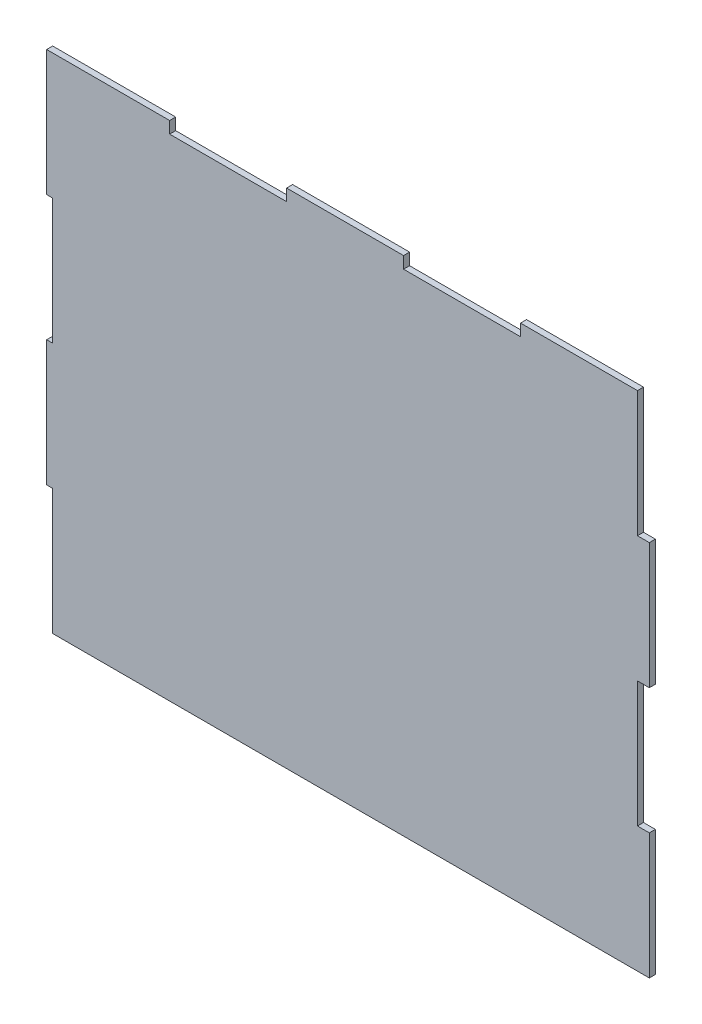
ISO-10303-21;
HEADER;
FILE_DESCRIPTION(('STEP AP214'),'2;1');
FILE_NAME('part.step','',(''),(''),'','','');
FILE_SCHEMA(('AUTOMOTIVE_DESIGN { 1 0 10303 214 1 1 1 1 }'));
ENDSEC;
DATA;
#1=APPLICATION_CONTEXT('core data for automotive mechanical design processes');
#2=APPLICATION_PROTOCOL_DEFINITION('international standard','automotive_design',2000,#1);
#3=PRODUCT_CONTEXT('',#1,'mechanical');
#4=PRODUCT('Part','Part','',(#3));
#5=PRODUCT_RELATED_PRODUCT_CATEGORY('part','',(#4));
#6=PRODUCT_DEFINITION_FORMATION('','',#4);
#7=PRODUCT_DEFINITION_CONTEXT('part definition',#1,'design');
#8=PRODUCT_DEFINITION('design','',#6,#7);
#9=PRODUCT_DEFINITION_SHAPE('','',#8);
#10=(LENGTH_UNIT() NAMED_UNIT(*) SI_UNIT(.MILLI.,.METRE.));
#11=(NAMED_UNIT(*) PLANE_ANGLE_UNIT() SI_UNIT($,.RADIAN.));
#12=(NAMED_UNIT(*) SI_UNIT($,.STERADIAN.) SOLID_ANGLE_UNIT());
#13=UNCERTAINTY_MEASURE_WITH_UNIT(LENGTH_MEASURE(1.E-05),#10,'distance_accuracy_value','');
#14=(GEOMETRIC_REPRESENTATION_CONTEXT(3) GLOBAL_UNCERTAINTY_ASSIGNED_CONTEXT((#13)) GLOBAL_UNIT_ASSIGNED_CONTEXT((#10,
#11,#12)) REPRESENTATION_CONTEXT('',''));
#15=CARTESIAN_POINT('',(0.,0.,0.));
#16=DIRECTION('',(0.,0.,1.));
#17=DIRECTION('',(1.,0.,0.));
#18=AXIS2_PLACEMENT_3D('',#15,#16,#17);
#19=CARTESIAN_POINT('',(59.0804,253.981711341585,3.048));
#20=DIRECTION('',(-1.,0.,0.));
#21=DIRECTION('',(0.,0.,1.));
#22=AXIS2_PLACEMENT_3D('',#19,#20,#21);
#23=PLANE('',#22);
#24=DIRECTION('',(0.,1.,0.));
#25=VECTOR('',#24,1.);
#26=CARTESIAN_POINT('',(59.0804,253.981711341585,0.));
#27=LINE('',#26,#25);
#28=CARTESIAN_POINT('',(59.0804,248.012711341585,0.));
#29=VERTEX_POINT('',#28);
#30=CARTESIAN_POINT('',(59.0804,253.981711341585,0.));
#31=VERTEX_POINT('',#30);
#32=EDGE_CURVE('E224',#29,#31,#27,.T.);
#33=ORIENTED_EDGE('',*,*,#32,.T.);
#34=DIRECTION('',(0.,0.,-1.));
#35=VECTOR('',#34,1.);
#36=CARTESIAN_POINT('',(59.0804,253.981711341585,3.048));
#37=LINE('',#36,#35);
#38=CARTESIAN_POINT('',(59.0804,253.981711341585,3.048));
#39=VERTEX_POINT('',#38);
#40=EDGE_CURVE('E11',#39,#31,#37,.T.);
#41=ORIENTED_EDGE('',*,*,#40,.F.);
#42=DIRECTION('',(0.,1.,0.));
#43=VECTOR('',#42,1.);
#44=CARTESIAN_POINT('',(59.0804,253.981711341585,3.048));
#45=LINE('',#44,#43);
#46=CARTESIAN_POINT('',(59.0804,248.012711341585,3.048));
#47=VERTEX_POINT('',#46);
#48=EDGE_CURVE('E270',#47,#39,#45,.T.);
#49=ORIENTED_EDGE('',*,*,#48,.F.);
#50=DIRECTION('',(0.,0.,-1.));
#51=VECTOR('',#50,1.);
#52=CARTESIAN_POINT('',(59.0804,248.012711341585,3.048));
#53=LINE('',#52,#51);
#54=EDGE_CURVE('E220',#47,#29,#53,.T.);
#55=ORIENTED_EDGE('',*,*,#54,.T.);
#56=EDGE_LOOP('',(#33,#41,#49,#55));
#57=FACE_BOUND('',#56,.T.);
#58=ADVANCED_FACE('F32',(#57),#23,.F.);
#59=CARTESIAN_POINT('',(-3.048,253.981711341585,3.048));
#60=DIRECTION('',(0.,-1.,0.));
#61=DIRECTION('',(0.,0.,-1.));
#62=AXIS2_PLACEMENT_3D('',#59,#60,#61);
#63=PLANE('',#62);
#64=DIRECTION('',(-1.,0.,0.));
#65=VECTOR('',#64,1.);
#66=CARTESIAN_POINT('',(-3.048,253.981711341585,0.));
#67=LINE('',#66,#65);
#68=CARTESIAN_POINT('',(-3.048,253.981711341585,0.));
#69=VERTEX_POINT('',#68);
#70=EDGE_CURVE('E227',#31,#69,#67,.T.);
#71=ORIENTED_EDGE('',*,*,#70,.T.);
#72=DIRECTION('',(0.,0.,-1.));
#73=VECTOR('',#72,1.);
#74=CARTESIAN_POINT('',(-3.048,253.981711341585,3.048));
#75=LINE('',#74,#73);
#76=CARTESIAN_POINT('',(-3.048,253.981711341585,3.048));
#77=VERTEX_POINT('',#76);
#78=EDGE_CURVE('E40',#77,#69,#75,.T.);
#79=ORIENTED_EDGE('',*,*,#78,.F.);
#80=DIRECTION('',(-1.,0.,0.));
#81=VECTOR('',#80,1.);
#82=CARTESIAN_POINT('',(-3.048,253.981711341585,3.048));
#83=LINE('',#82,#81);
#84=EDGE_CURVE('E139',#39,#77,#83,.T.);
#85=ORIENTED_EDGE('',*,*,#84,.F.);
#86=ORIENTED_EDGE('',*,*,#40,.T.);
#87=EDGE_LOOP('',(#71,#79,#85,#86));
#88=FACE_BOUND('',#87,.T.);
#89=ADVANCED_FACE('F408',(#88),#63,.F.);
#90=CARTESIAN_POINT('',(-3.048,190.5,3.048));
#91=DIRECTION('',(1.,0.,0.));
#92=DIRECTION('',(0.,0.,-1.));
#93=AXIS2_PLACEMENT_3D('',#90,#91,#92);
#94=PLANE('',#93);
#95=DIRECTION('',(0.,-1.,0.));
#96=VECTOR('',#95,1.);
#97=CARTESIAN_POINT('',(-3.048,190.5,0.));
#98=LINE('',#97,#96);
#99=CARTESIAN_POINT('',(-3.048,190.5,0.));
#100=VERTEX_POINT('',#99);
#101=EDGE_CURVE('E229',#69,#100,#98,.T.);
#102=ORIENTED_EDGE('',*,*,#101,.T.);
#103=DIRECTION('',(0.,0.,-1.));
#104=VECTOR('',#103,1.);
#105=CARTESIAN_POINT('',(-3.048,190.5,3.048));
#106=LINE('',#105,#104);
#107=CARTESIAN_POINT('',(-3.048,190.5,3.048));
#108=VERTEX_POINT('',#107);
#109=EDGE_CURVE('E325',#108,#100,#106,.T.);
#110=ORIENTED_EDGE('',*,*,#109,.F.);
#111=DIRECTION('',(0.,-1.,0.));
#112=VECTOR('',#111,1.);
#113=CARTESIAN_POINT('',(-3.048,190.5,3.048));
#114=LINE('',#113,#112);
#115=EDGE_CURVE('E333',#77,#108,#114,.T.);
#116=ORIENTED_EDGE('',*,*,#115,.F.);
#117=ORIENTED_EDGE('',*,*,#78,.T.);
#118=EDGE_LOOP('',(#102,#110,#116,#117));
#119=FACE_BOUND('',#118,.T.);
#120=ADVANCED_FACE('F331',(#119),#94,.F.);
#121=CARTESIAN_POINT('',(0.,190.5,3.048));
#122=DIRECTION('',(0.,1.,0.));
#123=DIRECTION('',(0.,0.,1.));
#124=AXIS2_PLACEMENT_3D('',#121,#122,#123);
#125=PLANE('',#124);
#126=DIRECTION('',(1.,0.,0.));
#127=VECTOR('',#126,1.);
#128=CARTESIAN_POINT('',(0.,190.5,0.));
#129=LINE('',#128,#127);
#130=CARTESIAN_POINT('',(0.,190.5,0.));
#131=VERTEX_POINT('',#130);
#132=EDGE_CURVE('E231',#100,#131,#129,.T.);
#133=ORIENTED_EDGE('',*,*,#132,.T.);
#134=DIRECTION('',(0.,0.,-1.));
#135=VECTOR('',#134,1.);
#136=CARTESIAN_POINT('',(0.,190.5,3.048));
#137=LINE('',#136,#135);
#138=CARTESIAN_POINT('',(0.,190.5,3.048));
#139=VERTEX_POINT('',#138);
#140=EDGE_CURVE('E322',#139,#131,#137,.T.);
#141=ORIENTED_EDGE('',*,*,#140,.F.);
#142=DIRECTION('',(1.,0.,0.));
#143=VECTOR('',#142,1.);
#144=CARTESIAN_POINT('',(0.,190.5,3.048));
#145=LINE('',#144,#143);
#146=EDGE_CURVE('E351',#108,#139,#145,.T.);
#147=ORIENTED_EDGE('',*,*,#146,.F.);
#148=ORIENTED_EDGE('',*,*,#109,.T.);
#149=EDGE_LOOP('',(#133,#141,#147,#148));
#150=FACE_BOUND('',#149,.T.);
#151=ADVANCED_FACE('F342',(#150),#125,.F.);
#152=CARTESIAN_POINT('',(0.,127.,3.048));
#153=DIRECTION('',(1.,0.,0.));
#154=DIRECTION('',(0.,0.,-1.));
#155=AXIS2_PLACEMENT_3D('',#152,#153,#154);
#156=PLANE('',#155);
#157=DIRECTION('',(0.,-1.,0.));
#158=VECTOR('',#157,1.);
#159=CARTESIAN_POINT('',(0.,127.,0.));
#160=LINE('',#159,#158);
#161=CARTESIAN_POINT('',(0.,127.,0.));
#162=VERTEX_POINT('',#161);
#163=EDGE_CURVE('E233',#131,#162,#160,.T.);
#164=ORIENTED_EDGE('',*,*,#163,.T.);
#165=DIRECTION('',(0.,0.,-1.));
#166=VECTOR('',#165,1.);
#167=CARTESIAN_POINT('',(0.,127.,3.048));
#168=LINE('',#167,#166);
#169=CARTESIAN_POINT('',(0.,127.,3.048));
#170=VERTEX_POINT('',#169);
#171=EDGE_CURVE('E319',#170,#162,#168,.T.);
#172=ORIENTED_EDGE('',*,*,#171,.F.);
#173=DIRECTION('',(0.,-1.,0.));
#174=VECTOR('',#173,1.);
#175=CARTESIAN_POINT('',(0.,127.,3.048));
#176=LINE('',#175,#174);
#177=EDGE_CURVE('E348',#139,#170,#176,.T.);
#178=ORIENTED_EDGE('',*,*,#177,.F.);
#179=ORIENTED_EDGE('',*,*,#140,.T.);
#180=EDGE_LOOP('',(#164,#172,#178,#179));
#181=FACE_BOUND('',#180,.T.);
#182=ADVANCED_FACE('F346',(#181),#156,.F.);
#183=CARTESIAN_POINT('',(0.,127.,3.048));
#184=DIRECTION('',(0.,-1.,0.));
#185=DIRECTION('',(0.,0.,-1.));
#186=AXIS2_PLACEMENT_3D('',#183,#184,#185);
#187=PLANE('',#186);
#188=DIRECTION('',(-1.,0.,0.));
#189=VECTOR('',#188,1.);
#190=CARTESIAN_POINT('',(0.,127.,0.));
#191=LINE('',#190,#189);
#192=CARTESIAN_POINT('',(-3.048,127.,0.));
#193=VERTEX_POINT('',#192);
#194=EDGE_CURVE('E235',#162,#193,#191,.T.);
#195=ORIENTED_EDGE('',*,*,#194,.T.);
#196=DIRECTION('',(0.,0.,-1.));
#197=VECTOR('',#196,1.);
#198=CARTESIAN_POINT('',(-3.048,127.,3.048));
#199=LINE('',#198,#197);
#200=CARTESIAN_POINT('',(-3.048,127.,3.048));
#201=VERTEX_POINT('',#200);
#202=EDGE_CURVE('E316',#201,#193,#199,.T.);
#203=ORIENTED_EDGE('',*,*,#202,.F.);
#204=DIRECTION('',(-1.,0.,0.));
#205=VECTOR('',#204,1.);
#206=CARTESIAN_POINT('',(0.,127.,3.048));
#207=LINE('',#206,#205);
#208=EDGE_CURVE('E350',#170,#201,#207,.T.);
#209=ORIENTED_EDGE('',*,*,#208,.F.);
#210=ORIENTED_EDGE('',*,*,#171,.T.);
#211=EDGE_LOOP('',(#195,#203,#209,#210));
#212=FACE_BOUND('',#211,.T.);
#213=ADVANCED_FACE('F421',(#212),#187,.F.);
#214=CARTESIAN_POINT('',(-3.048,63.5,3.048));
#215=DIRECTION('',(1.,0.,0.));
#216=DIRECTION('',(0.,0.,-1.));
#217=AXIS2_PLACEMENT_3D('',#214,#215,#216);
#218=PLANE('',#217);
#219=DIRECTION('',(0.,-1.,0.));
#220=VECTOR('',#219,1.);
#221=CARTESIAN_POINT('',(-3.048,63.5,0.));
#222=LINE('',#221,#220);
#223=CARTESIAN_POINT('',(-3.048,63.5,0.));
#224=VERTEX_POINT('',#223);
#225=EDGE_CURVE('E237',#193,#224,#222,.T.);
#226=ORIENTED_EDGE('',*,*,#225,.T.);
#227=DIRECTION('',(0.,0.,-1.));
#228=VECTOR('',#227,1.);
#229=CARTESIAN_POINT('',(-3.048,63.5,3.048));
#230=LINE('',#229,#228);
#231=CARTESIAN_POINT('',(-3.048,63.5,3.048));
#232=VERTEX_POINT('',#231);
#233=EDGE_CURVE('E313',#232,#224,#230,.T.);
#234=ORIENTED_EDGE('',*,*,#233,.F.);
#235=DIRECTION('',(0.,-1.,0.));
#236=VECTOR('',#235,1.);
#237=CARTESIAN_POINT('',(-3.048,63.5,3.048));
#238=LINE('',#237,#236);
#239=EDGE_CURVE('E353',#201,#232,#238,.T.);
#240=ORIENTED_EDGE('',*,*,#239,.F.);
#241=ORIENTED_EDGE('',*,*,#202,.T.);
#242=EDGE_LOOP('',(#226,#234,#240,#241));
#243=FACE_BOUND('',#242,.T.);
#244=ADVANCED_FACE('F424',(#243),#218,.F.);
#245=CARTESIAN_POINT('',(0.,63.5,3.048));
#246=DIRECTION('',(0.,1.,0.));
#247=DIRECTION('',(0.,0.,1.));
#248=AXIS2_PLACEMENT_3D('',#245,#246,#247);
#249=PLANE('',#248);
#250=DIRECTION('',(1.,0.,0.));
#251=VECTOR('',#250,1.);
#252=CARTESIAN_POINT('',(0.,63.5,0.));
#253=LINE('',#252,#251);
#254=CARTESIAN_POINT('',(0.,63.5,0.));
#255=VERTEX_POINT('',#254);
#256=EDGE_CURVE('E239',#224,#255,#253,.T.);
#257=ORIENTED_EDGE('',*,*,#256,.T.);
#258=DIRECTION('',(0.,0.,-1.));
#259=VECTOR('',#258,1.);
#260=CARTESIAN_POINT('',(0.,63.5,3.048));
#261=LINE('',#260,#259);
#262=CARTESIAN_POINT('',(0.,63.5,3.048));
#263=VERTEX_POINT('',#262);
#264=EDGE_CURVE('E310',#263,#255,#261,.T.);
#265=ORIENTED_EDGE('',*,*,#264,.F.);
#266=DIRECTION('',(1.,0.,0.));
#267=VECTOR('',#266,1.);
#268=CARTESIAN_POINT('',(0.,63.5,3.048));
#269=LINE('',#268,#267);
#270=EDGE_CURVE('E359',#232,#263,#269,.T.);
#271=ORIENTED_EDGE('',*,*,#270,.F.);
#272=ORIENTED_EDGE('',*,*,#233,.T.);
#273=EDGE_LOOP('',(#257,#265,#271,#272));
#274=FACE_BOUND('',#273,.T.);
#275=ADVANCED_FACE('F428',(#274),#249,.F.);
#276=CARTESIAN_POINT('',(0.,0.,3.048));
#277=DIRECTION('',(1.,0.,0.));
#278=DIRECTION('',(0.,0.,-1.));
#279=AXIS2_PLACEMENT_3D('',#276,#277,#278);
#280=PLANE('',#279);
#281=DIRECTION('',(0.,-1.,0.));
#282=VECTOR('',#281,1.);
#283=CARTESIAN_POINT('',(0.,0.,0.));
#284=LINE('',#283,#282);
#285=CARTESIAN_POINT('',(0.,0.,0.));
#286=VERTEX_POINT('',#285);
#287=EDGE_CURVE('E241',#255,#286,#284,.T.);
#288=ORIENTED_EDGE('',*,*,#287,.T.);
#289=DIRECTION('',(0.,0.,-1.));
#290=VECTOR('',#289,1.);
#291=CARTESIAN_POINT('',(0.,0.,3.048));
#292=LINE('',#291,#290);
#293=CARTESIAN_POINT('',(0.,0.,3.048));
#294=VERTEX_POINT('',#293);
#295=EDGE_CURVE('E307',#294,#286,#292,.T.);
#296=ORIENTED_EDGE('',*,*,#295,.F.);
#297=DIRECTION('',(0.,-1.,0.));
#298=VECTOR('',#297,1.);
#299=CARTESIAN_POINT('',(0.,0.,3.048));
#300=LINE('',#299,#298);
#301=EDGE_CURVE('E361',#263,#294,#300,.T.);
#302=ORIENTED_EDGE('',*,*,#301,.F.);
#303=ORIENTED_EDGE('',*,*,#264,.T.);
#304=EDGE_LOOP('',(#288,#296,#302,#303));
#305=FACE_BOUND('',#304,.T.);
#306=ADVANCED_FACE('F432',(#305),#280,.F.);
#307=CARTESIAN_POINT('',(0.,0.,3.048));
#308=DIRECTION('',(0.,1.,0.));
#309=DIRECTION('',(0.,0.,1.));
#310=AXIS2_PLACEMENT_3D('',#307,#308,#309);
#311=PLANE('',#310);
#312=DIRECTION('',(1.,0.,0.));
#313=VECTOR('',#312,1.);
#314=CARTESIAN_POINT('',(0.,0.,0.));
#315=LINE('',#314,#313);
#316=CARTESIAN_POINT('',(301.3964,0.,0.));
#317=VERTEX_POINT('',#316);
#318=EDGE_CURVE('E243',#286,#317,#315,.T.);
#319=ORIENTED_EDGE('',*,*,#318,.T.);
#320=DIRECTION('',(0.,0.,-1.));
#321=VECTOR('',#320,1.);
#322=CARTESIAN_POINT('',(301.3964,0.,3.048));
#323=LINE('',#322,#321);
#324=CARTESIAN_POINT('',(301.3964,0.,3.048));
#325=VERTEX_POINT('',#324);
#326=EDGE_CURVE('E304',#325,#317,#323,.T.);
#327=ORIENTED_EDGE('',*,*,#326,.F.);
#328=DIRECTION('',(1.,0.,0.));
#329=VECTOR('',#328,1.);
#330=CARTESIAN_POINT('',(0.,0.,3.048));
#331=LINE('',#330,#329);
#332=EDGE_CURVE('E363',#294,#325,#331,.T.);
#333=ORIENTED_EDGE('',*,*,#332,.F.);
#334=ORIENTED_EDGE('',*,*,#295,.T.);
#335=EDGE_LOOP('',(#319,#327,#333,#334));
#336=FACE_BOUND('',#335,.T.);
#337=ADVANCED_FACE('F436',(#336),#311,.F.);
#338=CARTESIAN_POINT('',(301.3964,0.,3.048));
#339=DIRECTION('',(-1.,0.,0.));
#340=DIRECTION('',(0.,0.,1.));
#341=AXIS2_PLACEMENT_3D('',#338,#339,#340);
#342=PLANE('',#341);
#343=DIRECTION('',(0.,1.,0.));
#344=VECTOR('',#343,1.);
#345=CARTESIAN_POINT('',(301.3964,0.,0.));
#346=LINE('',#345,#344);
#347=CARTESIAN_POINT('',(301.3964,63.5,0.));
#348=VERTEX_POINT('',#347);
#349=EDGE_CURVE('E245',#317,#348,#346,.T.);
#350=ORIENTED_EDGE('',*,*,#349,.T.);
#351=DIRECTION('',(0.,0.,-1.));
#352=VECTOR('',#351,1.);
#353=CARTESIAN_POINT('',(301.3964,63.5,3.048));
#354=LINE('',#353,#352);
#355=CARTESIAN_POINT('',(301.3964,63.5,3.048));
#356=VERTEX_POINT('',#355);
#357=EDGE_CURVE('E301',#356,#348,#354,.T.);
#358=ORIENTED_EDGE('',*,*,#357,.F.);
#359=DIRECTION('',(0.,1.,0.));
#360=VECTOR('',#359,1.);
#361=CARTESIAN_POINT('',(301.3964,0.,3.048));
#362=LINE('',#361,#360);
#363=EDGE_CURVE('E365',#325,#356,#362,.T.);
#364=ORIENTED_EDGE('',*,*,#363,.F.);
#365=ORIENTED_EDGE('',*,*,#326,.T.);
#366=EDGE_LOOP('',(#350,#358,#364,#365));
#367=FACE_BOUND('',#366,.T.);
#368=ADVANCED_FACE('F440',(#367),#342,.F.);
#369=CARTESIAN_POINT('',(301.3964,63.5,3.048));
#370=DIRECTION('',(0.,-1.,0.));
#371=DIRECTION('',(0.,0.,-1.));
#372=AXIS2_PLACEMENT_3D('',#369,#370,#371);
#373=PLANE('',#372);
#374=DIRECTION('',(-1.,0.,0.));
#375=VECTOR('',#374,1.);
#376=CARTESIAN_POINT('',(301.3964,63.5,0.));
#377=LINE('',#376,#375);
#378=CARTESIAN_POINT('',(295.402,63.5,0.));
#379=VERTEX_POINT('',#378);
#380=EDGE_CURVE('E247',#348,#379,#377,.T.);
#381=ORIENTED_EDGE('',*,*,#380,.T.);
#382=DIRECTION('',(0.,0.,-1.));
#383=VECTOR('',#382,1.);
#384=CARTESIAN_POINT('',(295.402,63.5,3.048));
#385=LINE('',#384,#383);
#386=CARTESIAN_POINT('',(295.402,63.5,3.048));
#387=VERTEX_POINT('',#386);
#388=EDGE_CURVE('E298',#387,#379,#385,.T.);
#389=ORIENTED_EDGE('',*,*,#388,.F.);
#390=DIRECTION('',(-1.,0.,0.));
#391=VECTOR('',#390,1.);
#392=CARTESIAN_POINT('',(301.3964,63.5,3.048));
#393=LINE('',#392,#391);
#394=EDGE_CURVE('E367',#356,#387,#393,.T.);
#395=ORIENTED_EDGE('',*,*,#394,.F.);
#396=ORIENTED_EDGE('',*,*,#357,.T.);
#397=EDGE_LOOP('',(#381,#389,#395,#396));
#398=FACE_BOUND('',#397,.T.);
#399=ADVANCED_FACE('F444',(#398),#373,.F.);
#400=CARTESIAN_POINT('',(295.402,63.5,3.048));
#401=DIRECTION('',(-1.,0.,0.));
#402=DIRECTION('',(0.,0.,1.));
#403=AXIS2_PLACEMENT_3D('',#400,#401,#402);
#404=PLANE('',#403);
#405=DIRECTION('',(0.,1.,0.));
#406=VECTOR('',#405,1.);
#407=CARTESIAN_POINT('',(295.402,63.5,0.));
#408=LINE('',#407,#406);
#409=CARTESIAN_POINT('',(295.402,126.981711341585,0.));
#410=VERTEX_POINT('',#409);
#411=EDGE_CURVE('E249',#379,#410,#408,.T.);
#412=ORIENTED_EDGE('',*,*,#411,.T.);
#413=DIRECTION('',(0.,0.,-1.));
#414=VECTOR('',#413,1.);
#415=CARTESIAN_POINT('',(295.402,126.981711341585,3.048));
#416=LINE('',#415,#414);
#417=CARTESIAN_POINT('',(295.402,126.981711341585,3.048));
#418=VERTEX_POINT('',#417);
#419=EDGE_CURVE('E295',#418,#410,#416,.T.);
#420=ORIENTED_EDGE('',*,*,#419,.F.);
#421=DIRECTION('',(0.,1.,0.));
#422=VECTOR('',#421,1.);
#423=CARTESIAN_POINT('',(295.402,63.5,3.048));
#424=LINE('',#423,#422);
#425=EDGE_CURVE('E369',#387,#418,#424,.T.);
#426=ORIENTED_EDGE('',*,*,#425,.F.);
#427=ORIENTED_EDGE('',*,*,#388,.T.);
#428=EDGE_LOOP('',(#412,#420,#426,#427));
#429=FACE_BOUND('',#428,.T.);
#430=ADVANCED_FACE('F448',(#429),#404,.F.);
#431=CARTESIAN_POINT('',(295.402,126.981711341585,3.048));
#432=DIRECTION('',(0.,1.,0.));
#433=DIRECTION('',(0.,0.,1.));
#434=AXIS2_PLACEMENT_3D('',#431,#432,#433);
#435=PLANE('',#434);
#436=DIRECTION('',(1.,0.,0.));
#437=VECTOR('',#436,1.);
#438=CARTESIAN_POINT('',(295.402,126.981711341585,0.));
#439=LINE('',#438,#437);
#440=CARTESIAN_POINT('',(301.3964,126.981711341585,0.));
#441=VERTEX_POINT('',#440);
#442=EDGE_CURVE('E251',#410,#441,#439,.T.);
#443=ORIENTED_EDGE('',*,*,#442,.T.);
#444=DIRECTION('',(0.,0.,-1.));
#445=VECTOR('',#444,1.);
#446=CARTESIAN_POINT('',(301.3964,126.981711341585,3.048));
#447=LINE('',#446,#445);
#448=CARTESIAN_POINT('',(301.3964,126.981711341585,3.048));
#449=VERTEX_POINT('',#448);
#450=EDGE_CURVE('E292',#449,#441,#447,.T.);
#451=ORIENTED_EDGE('',*,*,#450,.F.);
#452=DIRECTION('',(1.,0.,0.));
#453=VECTOR('',#452,1.);
#454=CARTESIAN_POINT('',(295.402,126.981711341585,3.048));
#455=LINE('',#454,#453);
#456=EDGE_CURVE('E371',#418,#449,#455,.T.);
#457=ORIENTED_EDGE('',*,*,#456,.F.);
#458=ORIENTED_EDGE('',*,*,#419,.T.);
#459=EDGE_LOOP('',(#443,#451,#457,#458));
#460=FACE_BOUND('',#459,.T.);
#461=ADVANCED_FACE('F452',(#460),#435,.F.);
#462=CARTESIAN_POINT('',(301.3964,126.981711341585,3.048));
#463=DIRECTION('',(-1.,0.,0.));
#464=DIRECTION('',(0.,-1.,0.));
#465=AXIS2_PLACEMENT_3D('',#462,#463,#464);
#466=PLANE('',#465);
#467=DIRECTION('',(0.,1.,0.));
#468=VECTOR('',#467,1.);
#469=CARTESIAN_POINT('',(301.3964,126.981711341585,0.));
#470=LINE('',#469,#468);
#471=CARTESIAN_POINT('',(301.3964,190.481711341585,0.));
#472=VERTEX_POINT('',#471);
#473=EDGE_CURVE('E253',#441,#472,#470,.T.);
#474=ORIENTED_EDGE('',*,*,#473,.T.);
#475=DIRECTION('',(0.,0.,-1.));
#476=VECTOR('',#475,1.);
#477=CARTESIAN_POINT('',(301.3964,190.481711341585,3.048));
#478=LINE('',#477,#476);
#479=CARTESIAN_POINT('',(301.3964,190.481711341585,3.048));
#480=VERTEX_POINT('',#479);
#481=EDGE_CURVE('E289',#480,#472,#478,.T.);
#482=ORIENTED_EDGE('',*,*,#481,.F.);
#483=DIRECTION('',(0.,1.,0.));
#484=VECTOR('',#483,1.);
#485=CARTESIAN_POINT('',(301.3964,126.981711341585,3.048));
#486=LINE('',#485,#484);
#487=EDGE_CURVE('E373',#449,#480,#486,.T.);
#488=ORIENTED_EDGE('',*,*,#487,.F.);
#489=ORIENTED_EDGE('',*,*,#450,.T.);
#490=EDGE_LOOP('',(#474,#482,#488,#489));
#491=FACE_BOUND('',#490,.T.);
#492=ADVANCED_FACE('F456',(#491),#466,.F.);
#493=CARTESIAN_POINT('',(301.3964,190.481711341585,3.048));
#494=DIRECTION('',(0.,-1.,0.));
#495=DIRECTION('',(0.,0.,-1.));
#496=AXIS2_PLACEMENT_3D('',#493,#494,#495);
#497=PLANE('',#496);
#498=DIRECTION('',(-1.,0.,0.));
#499=VECTOR('',#498,1.);
#500=CARTESIAN_POINT('',(301.3964,190.481711341585,0.));
#501=LINE('',#500,#499);
#502=CARTESIAN_POINT('',(295.402,190.481711341585,0.));
#503=VERTEX_POINT('',#502);
#504=EDGE_CURVE('E255',#472,#503,#501,.T.);
#505=ORIENTED_EDGE('',*,*,#504,.T.);
#506=DIRECTION('',(0.,0.,-1.));
#507=VECTOR('',#506,1.);
#508=CARTESIAN_POINT('',(295.402,190.481711341585,3.048));
#509=LINE('',#508,#507);
#510=CARTESIAN_POINT('',(295.402,190.481711341585,3.048));
#511=VERTEX_POINT('',#510);
#512=EDGE_CURVE('E286',#511,#503,#509,.T.);
#513=ORIENTED_EDGE('',*,*,#512,.F.);
#514=DIRECTION('',(-1.,0.,0.));
#515=VECTOR('',#514,1.);
#516=CARTESIAN_POINT('',(301.3964,190.481711341585,3.048));
#517=LINE('',#516,#515);
#518=EDGE_CURVE('E375',#480,#511,#517,.T.);
#519=ORIENTED_EDGE('',*,*,#518,.F.);
#520=ORIENTED_EDGE('',*,*,#481,.T.);
#521=EDGE_LOOP('',(#505,#513,#519,#520));
#522=FACE_BOUND('',#521,.T.);
#523=ADVANCED_FACE('F460',(#522),#497,.F.);
#524=CARTESIAN_POINT('',(295.402,190.481711341585,3.048));
#525=DIRECTION('',(-1.,0.,0.));
#526=DIRECTION('',(0.,-1.,0.));
#527=AXIS2_PLACEMENT_3D('',#524,#525,#526);
#528=PLANE('',#527);
#529=DIRECTION('',(0.,1.,0.));
#530=VECTOR('',#529,1.);
#531=CARTESIAN_POINT('',(295.402,190.481711341585,0.));
#532=LINE('',#531,#530);
#533=CARTESIAN_POINT('',(295.402,253.981711341585,0.));
#534=VERTEX_POINT('',#533);
#535=EDGE_CURVE('E257',#503,#534,#532,.T.);
#536=ORIENTED_EDGE('',*,*,#535,.T.);
#537=DIRECTION('',(0.,0.,-1.));
#538=VECTOR('',#537,1.);
#539=CARTESIAN_POINT('',(295.402,253.981711341585,3.048));
#540=LINE('',#539,#538);
#541=CARTESIAN_POINT('',(295.402,253.981711341585,3.048));
#542=VERTEX_POINT('',#541);
#543=EDGE_CURVE('E283',#542,#534,#540,.T.);
#544=ORIENTED_EDGE('',*,*,#543,.F.);
#545=DIRECTION('',(0.,1.,0.));
#546=VECTOR('',#545,1.);
#547=CARTESIAN_POINT('',(295.402,190.481711341585,3.048));
#548=LINE('',#547,#546);
#549=EDGE_CURVE('E377',#511,#542,#548,.T.);
#550=ORIENTED_EDGE('',*,*,#549,.F.);
#551=ORIENTED_EDGE('',*,*,#512,.T.);
#552=EDGE_LOOP('',(#536,#544,#550,#551));
#553=FACE_BOUND('',#552,.T.);
#554=ADVANCED_FACE('F464',(#553),#528,.F.);
#555=CARTESIAN_POINT('',(236.3216,253.981711341585,3.048));
#556=DIRECTION('',(0.,-1.,0.));
#557=DIRECTION('',(0.,0.,-1.));
#558=AXIS2_PLACEMENT_3D('',#555,#556,#557);
#559=PLANE('',#558);
#560=DIRECTION('',(-1.,0.,0.));
#561=VECTOR('',#560,1.);
#562=CARTESIAN_POINT('',(236.3216,253.981711341585,0.));
#563=LINE('',#562,#561);
#564=CARTESIAN_POINT('',(236.3216,253.981711341585,0.));
#565=VERTEX_POINT('',#564);
#566=EDGE_CURVE('E259',#534,#565,#563,.T.);
#567=ORIENTED_EDGE('',*,*,#566,.T.);
#568=DIRECTION('',(0.,0.,-1.));
#569=VECTOR('',#568,1.);
#570=CARTESIAN_POINT('',(236.3216,253.981711341585,3.048));
#571=LINE('',#570,#569);
#572=CARTESIAN_POINT('',(236.3216,253.981711341585,3.048));
#573=VERTEX_POINT('',#572);
#574=EDGE_CURVE('E280',#573,#565,#571,.T.);
#575=ORIENTED_EDGE('',*,*,#574,.F.);
#576=DIRECTION('',(-1.,0.,0.));
#577=VECTOR('',#576,1.);
#578=CARTESIAN_POINT('',(236.3216,253.981711341585,3.048));
#579=LINE('',#578,#577);
#580=EDGE_CURVE('E379',#542,#573,#579,.T.);
#581=ORIENTED_EDGE('',*,*,#580,.F.);
#582=ORIENTED_EDGE('',*,*,#543,.T.);
#583=EDGE_LOOP('',(#567,#575,#581,#582));
#584=FACE_BOUND('',#583,.T.);
#585=ADVANCED_FACE('F468',(#584),#559,.F.);
#586=CARTESIAN_POINT('',(236.3216,248.012711341585,3.048));
#587=DIRECTION('',(1.,0.,0.));
#588=DIRECTION('',(0.,0.,-1.));
#589=AXIS2_PLACEMENT_3D('',#586,#587,#588);
#590=PLANE('',#589);
#591=DIRECTION('',(0.,-1.,0.));
#592=VECTOR('',#591,1.);
#593=CARTESIAN_POINT('',(236.3216,248.012711341585,0.));
#594=LINE('',#593,#592);
#595=CARTESIAN_POINT('',(236.3216,248.012711341585,0.));
#596=VERTEX_POINT('',#595);
#597=EDGE_CURVE('E261',#565,#596,#594,.T.);
#598=ORIENTED_EDGE('',*,*,#597,.T.);
#599=DIRECTION('',(0.,0.,-1.));
#600=VECTOR('',#599,1.);
#601=CARTESIAN_POINT('',(236.3216,248.012711341585,3.048));
#602=LINE('',#601,#600);
#603=CARTESIAN_POINT('',(236.3216,248.012711341585,3.048));
#604=VERTEX_POINT('',#603);
#605=EDGE_CURVE('E277',#604,#596,#602,.T.);
#606=ORIENTED_EDGE('',*,*,#605,.F.);
#607=DIRECTION('',(0.,-1.,0.));
#608=VECTOR('',#607,1.);
#609=CARTESIAN_POINT('',(236.3216,248.012711341585,3.048));
#610=LINE('',#609,#608);
#611=EDGE_CURVE('E381',#573,#604,#610,.T.);
#612=ORIENTED_EDGE('',*,*,#611,.F.);
#613=ORIENTED_EDGE('',*,*,#574,.T.);
#614=EDGE_LOOP('',(#598,#606,#612,#613));
#615=FACE_BOUND('',#614,.T.);
#616=ADVANCED_FACE('F472',(#615),#590,.F.);
#617=CARTESIAN_POINT('',(177.2412,248.012711341585,3.048));
#618=DIRECTION('',(0.,-1.,0.));
#619=DIRECTION('',(1.,0.,0.));
#620=AXIS2_PLACEMENT_3D('',#617,#618,#619);
#621=PLANE('',#620);
#622=DIRECTION('',(-1.,0.,0.));
#623=VECTOR('',#622,1.);
#624=CARTESIAN_POINT('',(177.2412,248.012711341585,0.));
#625=LINE('',#624,#623);
#626=CARTESIAN_POINT('',(177.2412,248.012711341585,0.));
#627=VERTEX_POINT('',#626);
#628=EDGE_CURVE('E263',#596,#627,#625,.T.);
#629=ORIENTED_EDGE('',*,*,#628,.T.);
#630=DIRECTION('',(0.,0.,-1.));
#631=VECTOR('',#630,1.);
#632=CARTESIAN_POINT('',(177.2412,248.012711341585,3.048));
#633=LINE('',#632,#631);
#634=CARTESIAN_POINT('',(177.2412,248.012711341585,3.048));
#635=VERTEX_POINT('',#634);
#636=EDGE_CURVE('E274',#635,#627,#633,.T.);
#637=ORIENTED_EDGE('',*,*,#636,.F.);
#638=DIRECTION('',(-1.,0.,0.));
#639=VECTOR('',#638,1.);
#640=CARTESIAN_POINT('',(177.2412,248.012711341585,3.048));
#641=LINE('',#640,#639);
#642=EDGE_CURVE('E383',#604,#635,#641,.T.);
#643=ORIENTED_EDGE('',*,*,#642,.F.);
#644=ORIENTED_EDGE('',*,*,#605,.T.);
#645=EDGE_LOOP('',(#629,#637,#643,#644));
#646=FACE_BOUND('',#645,.T.);
#647=ADVANCED_FACE('F389',(#646),#621,.F.);
#648=CARTESIAN_POINT('',(177.2412,253.981711341585,3.048));
#649=DIRECTION('',(-1.,0.,0.));
#650=DIRECTION('',(0.,0.,1.));
#651=AXIS2_PLACEMENT_3D('',#648,#649,#650);
#652=PLANE('',#651);
#653=DIRECTION('',(0.,1.,0.));
#654=VECTOR('',#653,1.);
#655=CARTESIAN_POINT('',(177.2412,253.981711341585,0.));
#656=LINE('',#655,#654);
#657=CARTESIAN_POINT('',(177.2412,253.981711341585,0.));
#658=VERTEX_POINT('',#657);
#659=EDGE_CURVE('E265',#627,#658,#656,.T.);
#660=ORIENTED_EDGE('',*,*,#659,.T.);
#661=DIRECTION('',(0.,0.,-1.));
#662=VECTOR('',#661,1.);
#663=CARTESIAN_POINT('',(177.2412,253.981711341585,3.048));
#664=LINE('',#663,#662);
#665=CARTESIAN_POINT('',(177.2412,253.981711341585,3.048));
#666=VERTEX_POINT('',#665);
#667=EDGE_CURVE('E215',#666,#658,#664,.T.);
#668=ORIENTED_EDGE('',*,*,#667,.F.);
#669=DIRECTION('',(0.,1.,0.));
#670=VECTOR('',#669,1.);
#671=CARTESIAN_POINT('',(177.2412,253.981711341585,3.048));
#672=LINE('',#671,#670);
#673=EDGE_CURVE('E206',#635,#666,#672,.T.);
#674=ORIENTED_EDGE('',*,*,#673,.F.);
#675=ORIENTED_EDGE('',*,*,#636,.T.);
#676=EDGE_LOOP('',(#660,#668,#674,#675));
#677=FACE_BOUND('',#676,.T.);
#678=ADVANCED_FACE('F393',(#677),#652,.F.);
#679=CARTESIAN_POINT('',(118.1608,253.981711341585,3.048));
#680=DIRECTION('',(0.,-1.,0.));
#681=DIRECTION('',(0.,0.,-1.));
#682=AXIS2_PLACEMENT_3D('',#679,#680,#681);
#683=PLANE('',#682);
#684=DIRECTION('',(-1.,0.,0.));
#685=VECTOR('',#684,1.);
#686=CARTESIAN_POINT('',(118.1608,253.981711341585,0.));
#687=LINE('',#686,#685);
#688=CARTESIAN_POINT('',(118.1608,253.981711341585,0.));
#689=VERTEX_POINT('',#688);
#690=EDGE_CURVE('E214',#658,#689,#687,.T.);
#691=ORIENTED_EDGE('',*,*,#690,.T.);
#692=DIRECTION('',(0.,0.,-1.));
#693=VECTOR('',#692,1.);
#694=CARTESIAN_POINT('',(118.1608,253.981711341585,3.048));
#695=LINE('',#694,#693);
#696=CARTESIAN_POINT('',(118.1608,253.981711341585,3.048));
#697=VERTEX_POINT('',#696);
#698=EDGE_CURVE('E211',#697,#689,#695,.T.);
#699=ORIENTED_EDGE('',*,*,#698,.F.);
#700=DIRECTION('',(-1.,0.,0.));
#701=VECTOR('',#700,1.);
#702=CARTESIAN_POINT('',(118.1608,253.981711341585,3.048));
#703=LINE('',#702,#701);
#704=EDGE_CURVE('E200',#666,#697,#703,.T.);
#705=ORIENTED_EDGE('',*,*,#704,.F.);
#706=ORIENTED_EDGE('',*,*,#667,.T.);
#707=EDGE_LOOP('',(#691,#699,#705,#706));
#708=FACE_BOUND('',#707,.T.);
#709=ADVANCED_FACE('F212',(#708),#683,.F.);
#710=CARTESIAN_POINT('',(118.1608,248.012711341585,3.048));
#711=DIRECTION('',(1.,0.,0.));
#712=DIRECTION('',(0.,0.,-1.));
#713=AXIS2_PLACEMENT_3D('',#710,#711,#712);
#714=PLANE('',#713);
#715=DIRECTION('',(0.,-1.,0.));
#716=VECTOR('',#715,1.);
#717=CARTESIAN_POINT('',(118.1608,248.012711341585,0.));
#718=LINE('',#717,#716);
#719=CARTESIAN_POINT('',(118.1608,248.012711341585,0.));
#720=VERTEX_POINT('',#719);
#721=EDGE_CURVE('E125',#689,#720,#718,.T.);
#722=ORIENTED_EDGE('',*,*,#721,.T.);
#723=DIRECTION('',(0.,0.,-1.));
#724=VECTOR('',#723,1.);
#725=CARTESIAN_POINT('',(118.1608,248.012711341585,3.048));
#726=LINE('',#725,#724);
#727=CARTESIAN_POINT('',(118.1608,248.012711341585,3.048));
#728=VERTEX_POINT('',#727);
#729=EDGE_CURVE('E216',#728,#720,#726,.T.);
#730=ORIENTED_EDGE('',*,*,#729,.F.);
#731=DIRECTION('',(0.,-1.,0.));
#732=VECTOR('',#731,1.);
#733=CARTESIAN_POINT('',(118.1608,248.012711341585,3.048));
#734=LINE('',#733,#732);
#735=EDGE_CURVE('E204',#697,#728,#734,.T.);
#736=ORIENTED_EDGE('',*,*,#735,.F.);
#737=ORIENTED_EDGE('',*,*,#698,.T.);
#738=EDGE_LOOP('',(#722,#730,#736,#737));
#739=FACE_BOUND('',#738,.T.);
#740=ADVANCED_FACE('F218',(#739),#714,.F.);
#741=CARTESIAN_POINT('',(59.0804,248.012711341585,3.048));
#742=DIRECTION('',(0.,-1.,0.));
#743=DIRECTION('',(0.,0.,-1.));
#744=AXIS2_PLACEMENT_3D('',#741,#742,#743);
#745=PLANE('',#744);
#746=DIRECTION('',(-1.,0.,0.));
#747=VECTOR('',#746,1.);
#748=CARTESIAN_POINT('',(59.0804,248.012711341585,0.));
#749=LINE('',#748,#747);
#750=EDGE_CURVE('E131',#720,#29,#749,.T.);
#751=ORIENTED_EDGE('',*,*,#750,.T.);
#752=ORIENTED_EDGE('',*,*,#54,.F.);
#753=DIRECTION('',(-1.,0.,0.));
#754=VECTOR('',#753,1.);
#755=CARTESIAN_POINT('',(59.0804,248.012711341585,3.048));
#756=LINE('',#755,#754);
#757=EDGE_CURVE('E48',#728,#47,#756,.T.);
#758=ORIENTED_EDGE('',*,*,#757,.F.);
#759=ORIENTED_EDGE('',*,*,#729,.T.);
#760=EDGE_LOOP('',(#751,#752,#758,#759));
#761=FACE_BOUND('',#760,.T.);
#762=ADVANCED_FACE('F397',(#761),#745,.F.);
#763=CARTESIAN_POINT('',(0.,0.,3.048));
#764=DIRECTION('',(0.,0.,1.));
#765=DIRECTION('',(1.,0.,0.));
#766=AXIS2_PLACEMENT_3D('',#763,#764,#765);
#767=PLANE('',#766);
#768=ORIENTED_EDGE('',*,*,#48,.T.);
#769=ORIENTED_EDGE('',*,*,#84,.T.);
#770=ORIENTED_EDGE('',*,*,#115,.T.);
#771=ORIENTED_EDGE('',*,*,#146,.T.);
#772=ORIENTED_EDGE('',*,*,#177,.T.);
#773=ORIENTED_EDGE('',*,*,#208,.T.);
#774=ORIENTED_EDGE('',*,*,#239,.T.);
#775=ORIENTED_EDGE('',*,*,#270,.T.);
#776=ORIENTED_EDGE('',*,*,#301,.T.);
#777=ORIENTED_EDGE('',*,*,#332,.T.);
#778=ORIENTED_EDGE('',*,*,#363,.T.);
#779=ORIENTED_EDGE('',*,*,#394,.T.);
#780=ORIENTED_EDGE('',*,*,#425,.T.);
#781=ORIENTED_EDGE('',*,*,#456,.T.);
#782=ORIENTED_EDGE('',*,*,#487,.T.);
#783=ORIENTED_EDGE('',*,*,#518,.T.);
#784=ORIENTED_EDGE('',*,*,#549,.T.);
#785=ORIENTED_EDGE('',*,*,#580,.T.);
#786=ORIENTED_EDGE('',*,*,#611,.T.);
#787=ORIENTED_EDGE('',*,*,#642,.T.);
#788=ORIENTED_EDGE('',*,*,#673,.T.);
#789=ORIENTED_EDGE('',*,*,#704,.T.);
#790=ORIENTED_EDGE('',*,*,#735,.T.);
#791=ORIENTED_EDGE('',*,*,#757,.T.);
#792=EDGE_LOOP('',(#768,#769,#770,#771,#772,#773,#774,#775,#776,#777,#778,#779,#780,#781,#782,
#783,#784,#785,#786,#787,#788,#789,#790,#791));
#793=FACE_BOUND('',#792,.T.);
#794=ADVANCED_FACE('F202',(#793),#767,.T.);
#795=CARTESIAN_POINT('',(0.,0.,0.));
#796=DIRECTION('',(0.,0.,1.));
#797=DIRECTION('',(1.,0.,0.));
#798=AXIS2_PLACEMENT_3D('',#795,#796,#797);
#799=PLANE('',#798);
#800=ORIENTED_EDGE('',*,*,#32,.F.);
#801=ORIENTED_EDGE('',*,*,#750,.F.);
#802=ORIENTED_EDGE('',*,*,#721,.F.);
#803=ORIENTED_EDGE('',*,*,#690,.F.);
#804=ORIENTED_EDGE('',*,*,#659,.F.);
#805=ORIENTED_EDGE('',*,*,#628,.F.);
#806=ORIENTED_EDGE('',*,*,#597,.F.);
#807=ORIENTED_EDGE('',*,*,#566,.F.);
#808=ORIENTED_EDGE('',*,*,#535,.F.);
#809=ORIENTED_EDGE('',*,*,#504,.F.);
#810=ORIENTED_EDGE('',*,*,#473,.F.);
#811=ORIENTED_EDGE('',*,*,#442,.F.);
#812=ORIENTED_EDGE('',*,*,#411,.F.);
#813=ORIENTED_EDGE('',*,*,#380,.F.);
#814=ORIENTED_EDGE('',*,*,#349,.F.);
#815=ORIENTED_EDGE('',*,*,#318,.F.);
#816=ORIENTED_EDGE('',*,*,#287,.F.);
#817=ORIENTED_EDGE('',*,*,#256,.F.);
#818=ORIENTED_EDGE('',*,*,#225,.F.);
#819=ORIENTED_EDGE('',*,*,#194,.F.);
#820=ORIENTED_EDGE('',*,*,#163,.F.);
#821=ORIENTED_EDGE('',*,*,#132,.F.);
#822=ORIENTED_EDGE('',*,*,#101,.F.);
#823=ORIENTED_EDGE('',*,*,#70,.F.);
#824=EDGE_LOOP('',(#800,#801,#802,#803,#804,#805,#806,#807,#808,#809,#810,#811,#812,#813,#814,
#815,#816,#817,#818,#819,#820,#821,#822,#823));
#825=FACE_BOUND('',#824,.T.);
#826=ADVANCED_FACE('F337',(#825),#799,.F.);
#827=CLOSED_SHELL('',(#58,#89,#120,#151,#182,#213,#244,#275,#306,#337,#368,#399,#430,#461,#492,
#523,#554,#585,#616,#647,#678,#709,#740,#762,#794,#826));
#828=MANIFOLD_SOLID_BREP('B2',#827);
#829=ADVANCED_BREP_SHAPE_REPRESENTATION('',(#18,#828),#14);
#830=SHAPE_DEFINITION_REPRESENTATION(#9,#829);
ENDSEC;
END-ISO-10303-21;
